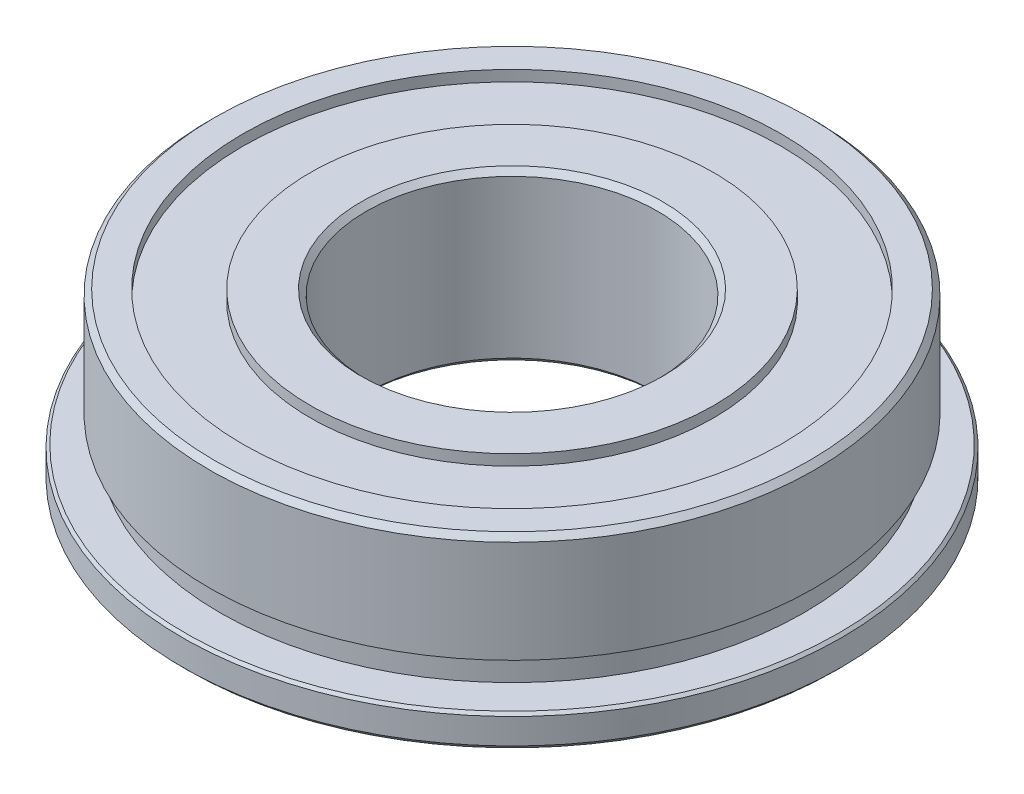
ISO-10303-21;
HEADER;
FILE_DESCRIPTION(('STEP AP214'),'2;1');
FILE_NAME('part.step','',(''),(''),'','','');
FILE_SCHEMA(('AUTOMOTIVE_DESIGN { 1 0 10303 214 1 1 1 1 }'));
ENDSEC;
DATA;
#1=APPLICATION_CONTEXT('core data for automotive mechanical design processes');
#2=APPLICATION_PROTOCOL_DEFINITION('international standard','automotive_design',2000,#1);
#3=PRODUCT_CONTEXT('',#1,'mechanical');
#4=PRODUCT('Part','Part','',(#3));
#5=PRODUCT_RELATED_PRODUCT_CATEGORY('part','',(#4));
#6=PRODUCT_DEFINITION_FORMATION('','',#4);
#7=PRODUCT_DEFINITION_CONTEXT('part definition',#1,'design');
#8=PRODUCT_DEFINITION('design','',#6,#7);
#9=PRODUCT_DEFINITION_SHAPE('','',#8);
#10=(LENGTH_UNIT() NAMED_UNIT(*) SI_UNIT(.MILLI.,.METRE.));
#11=(NAMED_UNIT(*) PLANE_ANGLE_UNIT() SI_UNIT($,.RADIAN.));
#12=(NAMED_UNIT(*) SI_UNIT($,.STERADIAN.) SOLID_ANGLE_UNIT());
#13=UNCERTAINTY_MEASURE_WITH_UNIT(LENGTH_MEASURE(1.E-05),#10,'distance_accuracy_value','');
#14=(GEOMETRIC_REPRESENTATION_CONTEXT(3) GLOBAL_UNCERTAINTY_ASSIGNED_CONTEXT((#13)) GLOBAL_UNIT_ASSIGNED_CONTEXT((#10,
#11,#12)) REPRESENTATION_CONTEXT('',''));
#15=CARTESIAN_POINT('',(0.,0.,0.));
#16=DIRECTION('',(0.,0.,1.));
#17=DIRECTION('',(1.,0.,0.));
#18=AXIS2_PLACEMENT_3D('',#15,#16,#17);
#19=CARTESIAN_POINT('',(0.,-3.46075,0.));
#20=DIRECTION('',(0.,-1.,0.));
#21=DIRECTION('',(-1.,0.,0.));
#22=AXIS2_PLACEMENT_3D('',#19,#20,#21);
#23=PLANE('',#22);
#24=CARTESIAN_POINT('',(0.,-3.46075,0.));
#25=DIRECTION('',(0.,1.,0.));
#26=DIRECTION('',(-1.,0.,0.));
#27=AXIS2_PLACEMENT_3D('',#24,#25,#26);
#28=CIRCLE('',#27,9.525);
#29=CARTESIAN_POINT('',(-9.525,-3.46075,0.));
#30=VERTEX_POINT('',#29);
#31=EDGE_CURVE('E10',#30,#30,#28,.T.);
#32=ORIENTED_EDGE('',*,*,#31,.T.);
#33=EDGE_LOOP('',(#32));
#34=FACE_BOUND('',#33,.T.);
#35=CARTESIAN_POINT('',(0.,-3.46075,0.));
#36=DIRECTION('',(0.,1.,0.));
#37=DIRECTION('',(-1.,0.,0.));
#38=AXIS2_PLACEMENT_3D('',#35,#36,#37);
#39=CIRCLE('',#38,12.7);
#40=CARTESIAN_POINT('',(-12.7,-3.46075,0.));
#41=VERTEX_POINT('',#40);
#42=EDGE_CURVE('E21',#41,#41,#39,.T.);
#43=ORIENTED_EDGE('',*,*,#42,.F.);
#44=EDGE_LOOP('',(#43));
#45=FACE_BOUND('',#44,.T.);
#46=ADVANCED_FACE('F15',(#34,#45),#23,.T.);
#47=CARTESIAN_POINT('',(0.,3.46075,0.));
#48=DIRECTION('',(0.,1.,0.));
#49=DIRECTION('',(-1.,0.,0.));
#50=AXIS2_PLACEMENT_3D('',#47,#48,#49);
#51=PLANE('',#50);
#52=CARTESIAN_POINT('',(0.,3.46075,0.));
#53=DIRECTION('',(0.,1.,0.));
#54=DIRECTION('',(-1.,0.,0.));
#55=AXIS2_PLACEMENT_3D('',#52,#53,#54);
#56=CIRCLE('',#55,12.7);
#57=CARTESIAN_POINT('',(-12.7,3.46075,0.));
#58=VERTEX_POINT('',#57);
#59=EDGE_CURVE('E25',#58,#58,#56,.T.);
#60=ORIENTED_EDGE('',*,*,#59,.T.);
#61=EDGE_LOOP('',(#60));
#62=FACE_BOUND('',#61,.T.);
#63=CARTESIAN_POINT('',(0.,3.46075,0.));
#64=DIRECTION('',(0.,1.,0.));
#65=DIRECTION('',(-1.,0.,0.));
#66=AXIS2_PLACEMENT_3D('',#63,#64,#65);
#67=CIRCLE('',#66,9.525);
#68=CARTESIAN_POINT('',(-9.525,3.46075,0.));
#69=VERTEX_POINT('',#68);
#70=EDGE_CURVE('E29',#69,#69,#67,.T.);
#71=ORIENTED_EDGE('',*,*,#70,.F.);
#72=EDGE_LOOP('',(#71));
#73=FACE_BOUND('',#72,.T.);
#74=ADVANCED_FACE('F118',(#62,#73),#51,.T.);
#75=CARTESIAN_POINT('',(0.,-2.38125,14.2875));
#76=DIRECTION('',(0.,-1.,0.));
#77=DIRECTION('',(1.,0.,0.));
#78=AXIS2_PLACEMENT_3D('',#75,#76,#77);
#79=PLANE('',#78);
#80=CARTESIAN_POINT('',(0.,-2.38125,0.));
#81=DIRECTION('',(0.,-1.,0.));
#82=DIRECTION('',(1.,0.,0.));
#83=AXIS2_PLACEMENT_3D('',#80,#81,#82);
#84=CIRCLE('',#83,13.7795);
#85=CARTESIAN_POINT('',(13.7795,-2.38125,0.));
#86=VERTEX_POINT('',#85);
#87=EDGE_CURVE('E34',#86,#86,#84,.T.);
#88=ORIENTED_EDGE('',*,*,#87,.T.);
#89=EDGE_LOOP('',(#88));
#90=FACE_BOUND('',#89,.T.);
#91=CARTESIAN_POINT('',(0.,-2.38125,0.));
#92=DIRECTION('',(0.,1.,0.));
#93=DIRECTION('',(1.,0.,0.));
#94=AXIS2_PLACEMENT_3D('',#91,#92,#93);
#95=CIRCLE('',#94,15.4305);
#96=CARTESIAN_POINT('',(15.4305,-2.38125,0.));
#97=VERTEX_POINT('',#96);
#98=EDGE_CURVE('E37',#97,#97,#95,.T.);
#99=ORIENTED_EDGE('',*,*,#98,.T.);
#100=EDGE_LOOP('',(#99));
#101=FACE_BOUND('',#100,.T.);
#102=ADVANCED_FACE('F111',(#90,#101),#79,.F.);
#103=CARTESIAN_POINT('',(0.,-1.11125,13.7795));
#104=DIRECTION('',(0.,1.,0.));
#105=DIRECTION('',(-1.,0.,0.));
#106=AXIS2_PLACEMENT_3D('',#103,#104,#105);
#107=PLANE('',#106);
#108=CARTESIAN_POINT('',(0.,-1.11125,0.));
#109=DIRECTION('',(0.,-1.,0.));
#110=DIRECTION('',(1.,0.,0.));
#111=AXIS2_PLACEMENT_3D('',#108,#109,#110);
#112=CIRCLE('',#111,14.2875);
#113=CARTESIAN_POINT('',(14.2875,-1.11125,0.));
#114=VERTEX_POINT('',#113);
#115=EDGE_CURVE('E40',#114,#114,#112,.T.);
#116=ORIENTED_EDGE('',*,*,#115,.T.);
#117=EDGE_LOOP('',(#116));
#118=FACE_BOUND('',#117,.T.);
#119=CARTESIAN_POINT('',(0.,-1.11125,0.));
#120=DIRECTION('',(0.,-1.,0.));
#121=DIRECTION('',(1.,0.,0.));
#122=AXIS2_PLACEMENT_3D('',#119,#120,#121);
#123=CIRCLE('',#122,13.7795);
#124=CARTESIAN_POINT('',(13.7795,-1.11125,0.));
#125=VERTEX_POINT('',#124);
#126=EDGE_CURVE('E43',#125,#125,#123,.T.);
#127=ORIENTED_EDGE('',*,*,#126,.F.);
#128=EDGE_LOOP('',(#127));
#129=FACE_BOUND('',#128,.T.);
#130=ADVANCED_FACE('F99',(#118,#129),#107,.F.);
#131=CARTESIAN_POINT('',(0.,3.96875,6.875));
#132=DIRECTION('',(0.,-1.,0.));
#133=DIRECTION('',(1.,0.,0.));
#134=AXIS2_PLACEMENT_3D('',#131,#132,#133);
#135=PLANE('',#134);
#136=CARTESIAN_POINT('',(0.,3.96875,0.));
#137=DIRECTION('',(0.,1.,0.));
#138=DIRECTION('',(1.,0.,0.));
#139=AXIS2_PLACEMENT_3D('',#136,#137,#138);
#140=CIRCLE('',#139,12.7);
#141=CARTESIAN_POINT('',(12.7,3.96875,0.));
#142=VERTEX_POINT('',#141);
#143=EDGE_CURVE('E46',#142,#142,#140,.T.);
#144=ORIENTED_EDGE('',*,*,#143,.F.);
#145=EDGE_LOOP('',(#144));
#146=FACE_BOUND('',#145,.T.);
#147=CARTESIAN_POINT('',(0.,3.96875,0.));
#148=DIRECTION('',(0.,1.,0.));
#149=DIRECTION('',(1.,0.,0.));
#150=AXIS2_PLACEMENT_3D('',#147,#148,#149);
#151=CIRCLE('',#150,14.0335);
#152=CARTESIAN_POINT('',(14.0335,3.96875,0.));
#153=VERTEX_POINT('',#152);
#154=EDGE_CURVE('E49',#153,#153,#151,.T.);
#155=ORIENTED_EDGE('',*,*,#154,.T.);
#156=EDGE_LOOP('',(#155));
#157=FACE_BOUND('',#156,.T.);
#158=ADVANCED_FACE('F96',(#146,#157),#135,.F.);
#159=CARTESIAN_POINT('',(0.,-3.96875,15.5575));
#160=DIRECTION('',(0.,1.,0.));
#161=DIRECTION('',(-1.,0.,0.));
#162=AXIS2_PLACEMENT_3D('',#159,#160,#161);
#163=PLANE('',#162);
#164=CARTESIAN_POINT('',(0.,-3.96875,0.));
#165=DIRECTION('',(0.,1.,0.));
#166=DIRECTION('',(-1.,0.,0.));
#167=AXIS2_PLACEMENT_3D('',#164,#165,#166);
#168=CIRCLE('',#167,12.7);
#169=CARTESIAN_POINT('',(-12.7,-3.96875,0.));
#170=VERTEX_POINT('',#169);
#171=EDGE_CURVE('E52',#170,#170,#168,.T.);
#172=ORIENTED_EDGE('',*,*,#171,.T.);
#173=EDGE_LOOP('',(#172));
#174=FACE_BOUND('',#173,.T.);
#175=CARTESIAN_POINT('',(0.,-3.96875,0.));
#176=DIRECTION('',(0.,-1.,0.));
#177=DIRECTION('',(-1.,0.,0.));
#178=AXIS2_PLACEMENT_3D('',#175,#176,#177);
#179=CIRCLE('',#178,15.3035);
#180=CARTESIAN_POINT('',(-15.3035,-3.96875,0.));
#181=VERTEX_POINT('',#180);
#182=EDGE_CURVE('E55',#181,#181,#179,.T.);
#183=ORIENTED_EDGE('',*,*,#182,.T.);
#184=EDGE_LOOP('',(#183));
#185=FACE_BOUND('',#184,.T.);
#186=ADVANCED_FACE('F98',(#174,#185),#163,.F.);
#187=CARTESIAN_POINT('',(0.,3.96875,0.));
#188=DIRECTION('',(0.,1.,0.));
#189=DIRECTION('',(1.,0.,0.));
#190=AXIS2_PLACEMENT_3D('',#187,#188,#189);
#191=CIRCLE('',#190,9.525);
#192=CARTESIAN_POINT('',(9.525,3.96875,0.));
#193=VERTEX_POINT('',#192);
#194=EDGE_CURVE('E58',#193,#193,#191,.T.);
#195=ORIENTED_EDGE('',*,*,#194,.T.);
#196=EDGE_LOOP('',(#195));
#197=FACE_BOUND('',#196,.T.);
#198=CARTESIAN_POINT('',(0.,3.96875,0.));
#199=DIRECTION('',(0.,-1.,0.));
#200=DIRECTION('',(1.,0.,0.));
#201=AXIS2_PLACEMENT_3D('',#198,#199,#200);
#202=CIRCLE('',#201,7.129);
#203=CARTESIAN_POINT('',(7.129,3.96875,0.));
#204=VERTEX_POINT('',#203);
#205=EDGE_CURVE('E61',#204,#204,#202,.T.);
#206=ORIENTED_EDGE('',*,*,#205,.T.);
#207=EDGE_LOOP('',(#206));
#208=FACE_BOUND('',#207,.T.);
#209=ADVANCED_FACE('F102',(#197,#208),#135,.F.);
#210=CARTESIAN_POINT('',(0.,-3.96875,0.));
#211=DIRECTION('',(0.,1.,0.));
#212=DIRECTION('',(-1.,0.,0.));
#213=AXIS2_PLACEMENT_3D('',#210,#211,#212);
#214=CIRCLE('',#213,9.525);
#215=CARTESIAN_POINT('',(-9.525,-3.96875,0.));
#216=VERTEX_POINT('',#215);
#217=EDGE_CURVE('E64',#216,#216,#214,.T.);
#218=ORIENTED_EDGE('',*,*,#217,.F.);
#219=EDGE_LOOP('',(#218));
#220=FACE_BOUND('',#219,.T.);
#221=CARTESIAN_POINT('',(0.,-3.96875,0.));
#222=DIRECTION('',(0.,1.,0.));
#223=DIRECTION('',(-1.,0.,0.));
#224=AXIS2_PLACEMENT_3D('',#221,#222,#223);
#225=CIRCLE('',#224,7.129);
#226=CARTESIAN_POINT('',(-7.129,-3.96875,0.));
#227=VERTEX_POINT('',#226);
#228=EDGE_CURVE('E67',#227,#227,#225,.T.);
#229=ORIENTED_EDGE('',*,*,#228,.T.);
#230=EDGE_LOOP('',(#229));
#231=FACE_BOUND('',#230,.T.);
#232=ADVANCED_FACE('F110',(#220,#231),#163,.F.);
#233=CARTESIAN_POINT('',(0.,-6.18055555555556,0.));
#234=DIRECTION('',(0.,-1.,0.));
#235=DIRECTION('',(1.,0.,0.));
#236=AXIS2_PLACEMENT_3D('',#233,#234,#235);
#237=CYLINDRICAL_SURFACE('',#236,15.5575);
#238=CARTESIAN_POINT('',(0.,-3.71475,0.));
#239=DIRECTION('',(0.,1.,0.));
#240=DIRECTION('',(-1.,0.,0.));
#241=AXIS2_PLACEMENT_3D('',#238,#239,#240);
#242=CIRCLE('',#241,15.5575);
#243=CARTESIAN_POINT('',(-15.5575,-3.71475,0.));
#244=VERTEX_POINT('',#243);
#245=EDGE_CURVE('E70',#244,#244,#242,.T.);
#246=ORIENTED_EDGE('',*,*,#245,.T.);
#247=EDGE_LOOP('',(#246));
#248=FACE_BOUND('',#247,.T.);
#249=CARTESIAN_POINT('',(0.,-2.50825,0.));
#250=DIRECTION('',(0.,-1.,0.));
#251=DIRECTION('',(1.,0.,0.));
#252=AXIS2_PLACEMENT_3D('',#249,#250,#251);
#253=CIRCLE('',#252,15.5575);
#254=CARTESIAN_POINT('',(15.5575,-2.50825,0.));
#255=VERTEX_POINT('',#254);
#256=EDGE_CURVE('E73',#255,#255,#253,.T.);
#257=ORIENTED_EDGE('',*,*,#256,.T.);
#258=EDGE_LOOP('',(#257));
#259=FACE_BOUND('',#258,.T.);
#260=ADVANCED_FACE('F161',(#248,#259),#237,.T.);
#261=CARTESIAN_POINT('',(0.,-6.18055555555556,0.));
#262=DIRECTION('',(0.,-1.,0.));
#263=DIRECTION('',(1.,0.,0.));
#264=AXIS2_PLACEMENT_3D('',#261,#262,#263);
#265=CYLINDRICAL_SURFACE('',#264,6.875);
#266=CARTESIAN_POINT('',(0.,-3.71475,0.));
#267=DIRECTION('',(0.,-1.,0.));
#268=DIRECTION('',(-1.,0.,0.));
#269=AXIS2_PLACEMENT_3D('',#266,#267,#268);
#270=CIRCLE('',#269,6.875);
#271=CARTESIAN_POINT('',(-6.875,-3.71475,0.));
#272=VERTEX_POINT('',#271);
#273=EDGE_CURVE('E76',#272,#272,#270,.T.);
#274=ORIENTED_EDGE('',*,*,#273,.T.);
#275=EDGE_LOOP('',(#274));
#276=FACE_BOUND('',#275,.T.);
#277=CARTESIAN_POINT('',(0.,3.71475,0.));
#278=DIRECTION('',(0.,1.,0.));
#279=DIRECTION('',(1.,0.,0.));
#280=AXIS2_PLACEMENT_3D('',#277,#278,#279);
#281=CIRCLE('',#280,6.875);
#282=CARTESIAN_POINT('',(6.875,3.71475,0.));
#283=VERTEX_POINT('',#282);
#284=EDGE_CURVE('E79',#283,#283,#281,.T.);
#285=ORIENTED_EDGE('',*,*,#284,.T.);
#286=EDGE_LOOP('',(#285));
#287=FACE_BOUND('',#286,.T.);
#288=ADVANCED_FACE('F171',(#276,#287),#265,.F.);
#289=CARTESIAN_POINT('',(0.,-6.18055555555556,0.));
#290=DIRECTION('',(0.,-1.,0.));
#291=DIRECTION('',(1.,0.,0.));
#292=AXIS2_PLACEMENT_3D('',#289,#290,#291);
#293=CYLINDRICAL_SURFACE('',#292,14.2875);
#294=ORIENTED_EDGE('',*,*,#115,.F.);
#295=EDGE_LOOP('',(#294));
#296=FACE_BOUND('',#295,.T.);
#297=CARTESIAN_POINT('',(0.,3.71475,0.));
#298=DIRECTION('',(0.,-1.,0.));
#299=DIRECTION('',(1.,0.,0.));
#300=AXIS2_PLACEMENT_3D('',#297,#298,#299);
#301=CIRCLE('',#300,14.2875);
#302=CARTESIAN_POINT('',(14.2875,3.71475,0.));
#303=VERTEX_POINT('',#302);
#304=EDGE_CURVE('E82',#303,#303,#301,.T.);
#305=ORIENTED_EDGE('',*,*,#304,.T.);
#306=EDGE_LOOP('',(#305));
#307=FACE_BOUND('',#306,.T.);
#308=ADVANCED_FACE('F86',(#296,#307),#293,.T.);
#309=CARTESIAN_POINT('',(0.,-6.18055555555556,0.));
#310=DIRECTION('',(0.,-1.,0.));
#311=DIRECTION('',(1.,0.,0.));
#312=AXIS2_PLACEMENT_3D('',#309,#310,#311);
#313=CYLINDRICAL_SURFACE('',#312,13.7795);
#314=ORIENTED_EDGE('',*,*,#87,.F.);
#315=EDGE_LOOP('',(#314));
#316=FACE_BOUND('',#315,.T.);
#317=ORIENTED_EDGE('',*,*,#126,.T.);
#318=EDGE_LOOP('',(#317));
#319=FACE_BOUND('',#318,.T.);
#320=ADVANCED_FACE('F146',(#316,#319),#313,.T.);
#321=CARTESIAN_POINT('',(0.,-3.46075,0.));
#322=DIRECTION('',(0.,-1.,0.));
#323=DIRECTION('',(1.,0.,0.));
#324=AXIS2_PLACEMENT_3D('',#321,#322,#323);
#325=CYLINDRICAL_SURFACE('',#324,12.7);
#326=ORIENTED_EDGE('',*,*,#143,.T.);
#327=EDGE_LOOP('',(#326));
#328=FACE_BOUND('',#327,.T.);
#329=ORIENTED_EDGE('',*,*,#59,.F.);
#330=EDGE_LOOP('',(#329));
#331=FACE_BOUND('',#330,.T.);
#332=ADVANCED_FACE('F136',(#328,#331),#325,.F.);
#333=CARTESIAN_POINT('',(0.,-3.46075,0.));
#334=DIRECTION('',(0.,-1.,0.));
#335=DIRECTION('',(1.,0.,0.));
#336=AXIS2_PLACEMENT_3D('',#333,#334,#335);
#337=CYLINDRICAL_SURFACE('',#336,9.525);
#338=ORIENTED_EDGE('',*,*,#194,.F.);
#339=EDGE_LOOP('',(#338));
#340=FACE_BOUND('',#339,.T.);
#341=ORIENTED_EDGE('',*,*,#70,.T.);
#342=EDGE_LOOP('',(#341));
#343=FACE_BOUND('',#342,.T.);
#344=ADVANCED_FACE('F133',(#340,#343),#337,.T.);
#345=ORIENTED_EDGE('',*,*,#171,.F.);
#346=EDGE_LOOP('',(#345));
#347=FACE_BOUND('',#346,.T.);
#348=ORIENTED_EDGE('',*,*,#42,.T.);
#349=EDGE_LOOP('',(#348));
#350=FACE_BOUND('',#349,.T.);
#351=ADVANCED_FACE('F135',(#347,#350),#325,.F.);
#352=ORIENTED_EDGE('',*,*,#217,.T.);
#353=EDGE_LOOP('',(#352));
#354=FACE_BOUND('',#353,.T.);
#355=ORIENTED_EDGE('',*,*,#31,.F.);
#356=EDGE_LOOP('',(#355));
#357=FACE_BOUND('',#356,.T.);
#358=ADVANCED_FACE('F139',(#354,#357),#337,.T.);
#359=CARTESIAN_POINT('',(0.,-3.96875,0.));
#360=DIRECTION('',(0.,1.,0.));
#361=DIRECTION('',(-1.,0.,0.));
#362=AXIS2_PLACEMENT_3D('',#359,#360,#361);
#363=CONICAL_SURFACE('',#362,15.3035,0.785398163397455);
#364=ORIENTED_EDGE('',*,*,#245,.F.);
#365=EDGE_LOOP('',(#364));
#366=FACE_BOUND('',#365,.T.);
#367=ORIENTED_EDGE('',*,*,#182,.F.);
#368=EDGE_LOOP('',(#367));
#369=FACE_BOUND('',#368,.T.);
#370=ADVANCED_FACE('F92',(#366,#369),#363,.T.);
#371=CARTESIAN_POINT('',(0.,3.71475,0.));
#372=DIRECTION('',(0.,-1.,0.));
#373=DIRECTION('',(1.,0.,0.));
#374=AXIS2_PLACEMENT_3D('',#371,#372,#373);
#375=CONICAL_SURFACE('',#374,14.2875,0.785398163397445);
#376=ORIENTED_EDGE('',*,*,#304,.F.);
#377=EDGE_LOOP('',(#376));
#378=FACE_BOUND('',#377,.T.);
#379=ORIENTED_EDGE('',*,*,#154,.F.);
#380=EDGE_LOOP('',(#379));
#381=FACE_BOUND('',#380,.T.);
#382=ADVANCED_FACE('F88',(#378,#381),#375,.T.);
#383=CARTESIAN_POINT('',(0.,3.96875,0.));
#384=DIRECTION('',(0.,1.,0.));
#385=DIRECTION('',(-1.,0.,0.));
#386=AXIS2_PLACEMENT_3D('',#383,#384,#385);
#387=CONICAL_SURFACE('',#386,7.129,0.785398163397446);
#388=ORIENTED_EDGE('',*,*,#205,.F.);
#389=EDGE_LOOP('',(#388));
#390=FACE_BOUND('',#389,.T.);
#391=ORIENTED_EDGE('',*,*,#284,.F.);
#392=EDGE_LOOP('',(#391));
#393=FACE_BOUND('',#392,.T.);
#394=ADVANCED_FACE('F91',(#390,#393),#387,.F.);
#395=CARTESIAN_POINT('',(0.,-3.71475,0.));
#396=DIRECTION('',(0.,-1.,0.));
#397=DIRECTION('',(1.,0.,0.));
#398=AXIS2_PLACEMENT_3D('',#395,#396,#397);
#399=CONICAL_SURFACE('',#398,6.875,0.785398163397442);
#400=ORIENTED_EDGE('',*,*,#228,.F.);
#401=EDGE_LOOP('',(#400));
#402=FACE_BOUND('',#401,.T.);
#403=ORIENTED_EDGE('',*,*,#273,.F.);
#404=EDGE_LOOP('',(#403));
#405=FACE_BOUND('',#404,.T.);
#406=ADVANCED_FACE('F164',(#402,#405),#399,.F.);
#407=CARTESIAN_POINT('',(0.,-2.50825,0.));
#408=DIRECTION('',(0.,-1.,0.));
#409=DIRECTION('',(1.,0.,0.));
#410=AXIS2_PLACEMENT_3D('',#407,#408,#409);
#411=CONICAL_SURFACE('',#410,15.5575,0.785398163397442);
#412=ORIENTED_EDGE('',*,*,#256,.F.);
#413=EDGE_LOOP('',(#412));
#414=FACE_BOUND('',#413,.T.);
#415=ORIENTED_EDGE('',*,*,#98,.F.);
#416=EDGE_LOOP('',(#415));
#417=FACE_BOUND('',#416,.T.);
#418=ADVANCED_FACE('F167',(#414,#417),#411,.T.);
#419=CLOSED_SHELL('',(#46,#74,#102,#130,#158,#186,#209,#232,#260,#288,#308,#320,#332,#344,#351,
#358,#370,#382,#394,#406,#418));
#420=MANIFOLD_SOLID_BREP('B1',#419);
#421=ADVANCED_BREP_SHAPE_REPRESENTATION('',(#18,#420),#14);
#422=SHAPE_DEFINITION_REPRESENTATION(#9,#421);
ENDSEC;
END-ISO-10303-21;
